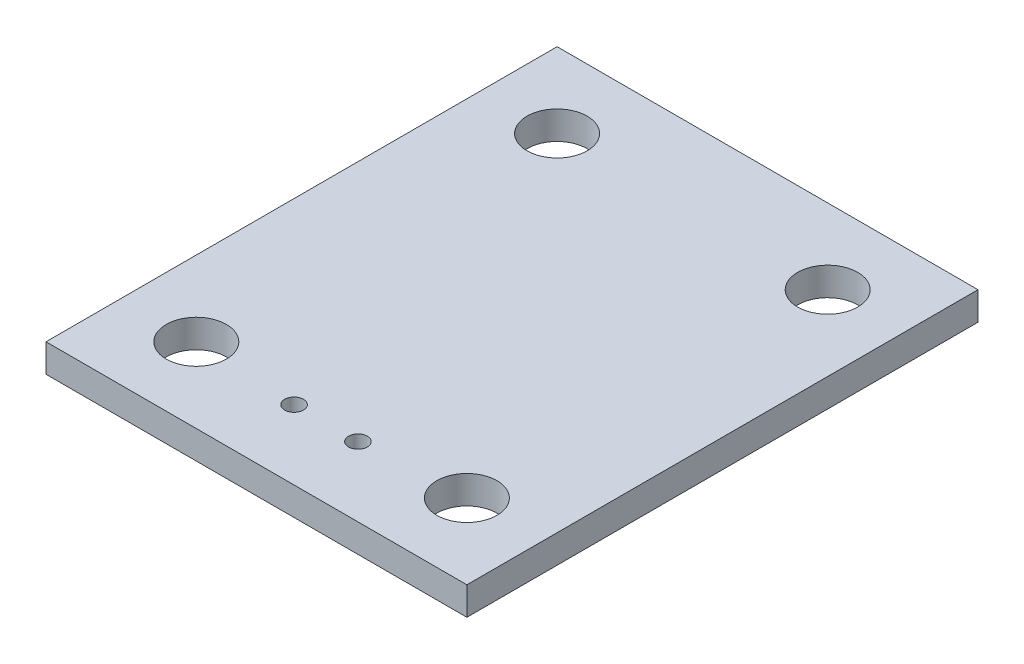
ISO-10303-21;
HEADER;
FILE_DESCRIPTION(('STEP AP214'),'2;1');
FILE_NAME('part.step','',(''),(''),'','','');
FILE_SCHEMA(('AUTOMOTIVE_DESIGN { 1 0 10303 214 1 1 1 1 }'));
ENDSEC;
DATA;
#1=APPLICATION_CONTEXT('core data for automotive mechanical design processes');
#2=APPLICATION_PROTOCOL_DEFINITION('international standard','automotive_design',2000,#1);
#3=PRODUCT_CONTEXT('',#1,'mechanical');
#4=PRODUCT('Part','Part','',(#3));
#5=PRODUCT_RELATED_PRODUCT_CATEGORY('part','',(#4));
#6=PRODUCT_DEFINITION_FORMATION('','',#4);
#7=PRODUCT_DEFINITION_CONTEXT('part definition',#1,'design');
#8=PRODUCT_DEFINITION('design','',#6,#7);
#9=PRODUCT_DEFINITION_SHAPE('','',#8);
#10=(LENGTH_UNIT() NAMED_UNIT(*) SI_UNIT(.MILLI.,.METRE.));
#11=(NAMED_UNIT(*) PLANE_ANGLE_UNIT() SI_UNIT($,.RADIAN.));
#12=(NAMED_UNIT(*) SI_UNIT($,.STERADIAN.) SOLID_ANGLE_UNIT());
#13=UNCERTAINTY_MEASURE_WITH_UNIT(LENGTH_MEASURE(1.E-05),#10,'distance_accuracy_value','');
#14=(GEOMETRIC_REPRESENTATION_CONTEXT(3) GLOBAL_UNCERTAINTY_ASSIGNED_CONTEXT((#13)) GLOBAL_UNIT_ASSIGNED_CONTEXT((#10,
#11,#12)) REPRESENTATION_CONTEXT('',''));
#15=CARTESIAN_POINT('',(0.,0.,0.));
#16=DIRECTION('',(0.,0.,1.));
#17=DIRECTION('',(1.,0.,0.));
#18=AXIS2_PLACEMENT_3D('',#15,#16,#17);
#19=CARTESIAN_POINT('',(-11.2,-1.5,-13.6));
#20=DIRECTION('',(-1.,0.,0.));
#21=DIRECTION('',(0.,0.,1.));
#22=AXIS2_PLACEMENT_3D('',#19,#20,#21);
#23=PLANE('',#22);
#24=DIRECTION('',(0.,0.,1.));
#25=VECTOR('',#24,1.);
#26=CARTESIAN_POINT('',(-11.2,0.,-13.6));
#27=LINE('',#26,#25);
#28=CARTESIAN_POINT('',(-11.2,0.,-13.6));
#29=VERTEX_POINT('',#28);
#30=CARTESIAN_POINT('',(-11.2,0.,13.6));
#31=VERTEX_POINT('',#30);
#32=EDGE_CURVE('E97',#29,#31,#27,.T.);
#33=ORIENTED_EDGE('',*,*,#32,.F.);
#34=DIRECTION('',(0.,1.,0.));
#35=VECTOR('',#34,1.);
#36=CARTESIAN_POINT('',(-11.2,-1.5,-13.6));
#37=LINE('',#36,#35);
#38=CARTESIAN_POINT('',(-11.2,-1.5,-13.6));
#39=VERTEX_POINT('',#38);
#40=EDGE_CURVE('E11',#39,#29,#37,.T.);
#41=ORIENTED_EDGE('',*,*,#40,.F.);
#42=DIRECTION('',(0.,0.,1.));
#43=VECTOR('',#42,1.);
#44=CARTESIAN_POINT('',(-11.2,-1.5,-13.6));
#45=LINE('',#44,#43);
#46=CARTESIAN_POINT('',(-11.2,-1.5,13.6));
#47=VERTEX_POINT('',#46);
#48=EDGE_CURVE('E90',#39,#47,#45,.T.);
#49=ORIENTED_EDGE('',*,*,#48,.T.);
#50=DIRECTION('',(0.,1.,0.));
#51=VECTOR('',#50,1.);
#52=CARTESIAN_POINT('',(-11.2,-1.5,13.6));
#53=LINE('',#52,#51);
#54=EDGE_CURVE('E35',#47,#31,#53,.T.);
#55=ORIENTED_EDGE('',*,*,#54,.T.);
#56=EDGE_LOOP('',(#33,#41,#49,#55));
#57=FACE_BOUND('',#56,.T.);
#58=ADVANCED_FACE('F32',(#57),#23,.T.);
#59=CARTESIAN_POINT('',(-11.2,-1.5,-13.6));
#60=DIRECTION('',(0.,0.,-1.));
#61=DIRECTION('',(-1.,0.,0.));
#62=AXIS2_PLACEMENT_3D('',#59,#60,#61);
#63=PLANE('',#62);
#64=DIRECTION('',(-1.,0.,0.));
#65=VECTOR('',#64,1.);
#66=CARTESIAN_POINT('',(-11.2,0.,-13.6));
#67=LINE('',#66,#65);
#68=CARTESIAN_POINT('',(11.2,0.,-13.6));
#69=VERTEX_POINT('',#68);
#70=EDGE_CURVE('E92',#69,#29,#67,.T.);
#71=ORIENTED_EDGE('',*,*,#70,.F.);
#72=DIRECTION('',(0.,1.,0.));
#73=VECTOR('',#72,1.);
#74=CARTESIAN_POINT('',(11.2,-1.5,-13.6));
#75=LINE('',#74,#73);
#76=CARTESIAN_POINT('',(11.2,-1.5,-13.6));
#77=VERTEX_POINT('',#76);
#78=EDGE_CURVE('E41',#77,#69,#75,.T.);
#79=ORIENTED_EDGE('',*,*,#78,.F.);
#80=DIRECTION('',(-1.,0.,0.));
#81=VECTOR('',#80,1.);
#82=CARTESIAN_POINT('',(-11.2,-1.5,-13.6));
#83=LINE('',#82,#81);
#84=EDGE_CURVE('E87',#77,#39,#83,.T.);
#85=ORIENTED_EDGE('',*,*,#84,.T.);
#86=ORIENTED_EDGE('',*,*,#40,.T.);
#87=EDGE_LOOP('',(#71,#79,#85,#86));
#88=FACE_BOUND('',#87,.T.);
#89=ADVANCED_FACE('F108',(#88),#63,.T.);
#90=CARTESIAN_POINT('',(11.2,-1.5,-13.6));
#91=DIRECTION('',(1.,0.,0.));
#92=DIRECTION('',(0.,0.,-1.));
#93=AXIS2_PLACEMENT_3D('',#90,#91,#92);
#94=PLANE('',#93);
#95=DIRECTION('',(0.,0.,-1.));
#96=VECTOR('',#95,1.);
#97=CARTESIAN_POINT('',(11.2,0.,-13.6));
#98=LINE('',#97,#96);
#99=CARTESIAN_POINT('',(11.2,0.,13.6));
#100=VERTEX_POINT('',#99);
#101=EDGE_CURVE('E82',#100,#69,#98,.T.);
#102=ORIENTED_EDGE('',*,*,#101,.F.);
#103=DIRECTION('',(0.,1.,0.));
#104=VECTOR('',#103,1.);
#105=CARTESIAN_POINT('',(11.2,-1.5,13.6));
#106=LINE('',#105,#104);
#107=CARTESIAN_POINT('',(11.2,-1.5,13.6));
#108=VERTEX_POINT('',#107);
#109=EDGE_CURVE('E77',#108,#100,#106,.T.);
#110=ORIENTED_EDGE('',*,*,#109,.F.);
#111=DIRECTION('',(0.,0.,-1.));
#112=VECTOR('',#111,1.);
#113=CARTESIAN_POINT('',(11.2,-1.5,-13.6));
#114=LINE('',#113,#112);
#115=EDGE_CURVE('E80',#108,#77,#114,.T.);
#116=ORIENTED_EDGE('',*,*,#115,.T.);
#117=ORIENTED_EDGE('',*,*,#78,.T.);
#118=EDGE_LOOP('',(#102,#110,#116,#117));
#119=FACE_BOUND('',#118,.T.);
#120=ADVANCED_FACE('F79',(#119),#94,.T.);
#121=CARTESIAN_POINT('',(-11.2,-1.5,13.6));
#122=DIRECTION('',(0.,0.,1.));
#123=DIRECTION('',(1.,0.,0.));
#124=AXIS2_PLACEMENT_3D('',#121,#122,#123);
#125=PLANE('',#124);
#126=DIRECTION('',(1.,0.,0.));
#127=VECTOR('',#126,1.);
#128=CARTESIAN_POINT('',(-11.2,0.,13.6));
#129=LINE('',#128,#127);
#130=EDGE_CURVE('E100',#31,#100,#129,.T.);
#131=ORIENTED_EDGE('',*,*,#130,.F.);
#132=ORIENTED_EDGE('',*,*,#54,.F.);
#133=DIRECTION('',(1.,0.,0.));
#134=VECTOR('',#133,1.);
#135=CARTESIAN_POINT('',(-11.2,-1.5,13.6));
#136=LINE('',#135,#134);
#137=EDGE_CURVE('E86',#47,#108,#136,.T.);
#138=ORIENTED_EDGE('',*,*,#137,.T.);
#139=ORIENTED_EDGE('',*,*,#109,.T.);
#140=EDGE_LOOP('',(#131,#132,#138,#139));
#141=FACE_BOUND('',#140,.T.);
#142=ADVANCED_FACE('F89',(#141),#125,.T.);
#143=CARTESIAN_POINT('',(0.,-1.5,0.));
#144=DIRECTION('',(0.,1.,0.));
#145=DIRECTION('',(0.,0.,1.));
#146=AXIS2_PLACEMENT_3D('',#143,#144,#145);
#147=PLANE('',#146);
#148=CARTESIAN_POINT('',(7.2,-1.5,9.59999999999999));
#149=DIRECTION('',(0.,1.,0.));
#150=DIRECTION('',(0.,0.,1.));
#151=AXIS2_PLACEMENT_3D('',#148,#149,#150);
#152=CIRCLE('',#151,1.6);
#153=CARTESIAN_POINT('',(7.2,-1.5,11.2));
#154=VERTEX_POINT('',#153);
#155=EDGE_CURVE('E157',#154,#154,#152,.T.);
#156=ORIENTED_EDGE('',*,*,#155,.T.);
#157=EDGE_LOOP('',(#156));
#158=FACE_BOUND('',#157,.T.);
#159=CARTESIAN_POINT('',(1.7,-1.5,9.9));
#160=DIRECTION('',(0.,1.,0.));
#161=DIRECTION('',(0.,0.,1.));
#162=AXIS2_PLACEMENT_3D('',#159,#160,#161);
#163=CIRCLE('',#162,0.5);
#164=CARTESIAN_POINT('',(1.7,-1.5,10.4));
#165=VERTEX_POINT('',#164);
#166=EDGE_CURVE('E165',#165,#165,#163,.T.);
#167=ORIENTED_EDGE('',*,*,#166,.T.);
#168=EDGE_LOOP('',(#167));
#169=FACE_BOUND('',#168,.T.);
#170=CARTESIAN_POINT('',(-1.7,-1.5,9.9));
#171=DIRECTION('',(0.,1.,0.));
#172=DIRECTION('',(0.,0.,1.));
#173=AXIS2_PLACEMENT_3D('',#170,#171,#172);
#174=CIRCLE('',#173,0.5);
#175=CARTESIAN_POINT('',(-1.7,-1.5,10.4));
#176=VERTEX_POINT('',#175);
#177=EDGE_CURVE('E171',#176,#176,#174,.T.);
#178=ORIENTED_EDGE('',*,*,#177,.T.);
#179=EDGE_LOOP('',(#178));
#180=FACE_BOUND('',#179,.T.);
#181=CARTESIAN_POINT('',(-7.2,-1.5,9.59999999999999));
#182=DIRECTION('',(0.,1.,0.));
#183=DIRECTION('',(0.,0.,1.));
#184=AXIS2_PLACEMENT_3D('',#181,#182,#183);
#185=CIRCLE('',#184,1.6);
#186=CARTESIAN_POINT('',(-7.2,-1.5,11.2));
#187=VERTEX_POINT('',#186);
#188=EDGE_CURVE('E177',#187,#187,#185,.T.);
#189=ORIENTED_EDGE('',*,*,#188,.T.);
#190=EDGE_LOOP('',(#189));
#191=FACE_BOUND('',#190,.T.);
#192=CARTESIAN_POINT('',(-7.2,-1.5,-9.6));
#193=DIRECTION('',(0.,1.,0.));
#194=DIRECTION('',(0.,0.,1.));
#195=AXIS2_PLACEMENT_3D('',#192,#193,#194);
#196=CIRCLE('',#195,1.6);
#197=CARTESIAN_POINT('',(-7.2,-1.5,-8.));
#198=VERTEX_POINT('',#197);
#199=EDGE_CURVE('E183',#198,#198,#196,.T.);
#200=ORIENTED_EDGE('',*,*,#199,.T.);
#201=EDGE_LOOP('',(#200));
#202=FACE_BOUND('',#201,.T.);
#203=CARTESIAN_POINT('',(7.2,-1.5,-9.6));
#204=DIRECTION('',(0.,1.,0.));
#205=DIRECTION('',(0.,0.,1.));
#206=AXIS2_PLACEMENT_3D('',#203,#204,#205);
#207=CIRCLE('',#206,1.6);
#208=CARTESIAN_POINT('',(7.2,-1.5,-8.));
#209=VERTEX_POINT('',#208);
#210=EDGE_CURVE('E101',#209,#209,#207,.T.);
#211=ORIENTED_EDGE('',*,*,#210,.T.);
#212=EDGE_LOOP('',(#211));
#213=FACE_BOUND('',#212,.T.);
#214=ORIENTED_EDGE('',*,*,#48,.F.);
#215=ORIENTED_EDGE('',*,*,#84,.F.);
#216=ORIENTED_EDGE('',*,*,#115,.F.);
#217=ORIENTED_EDGE('',*,*,#137,.F.);
#218=EDGE_LOOP('',(#214,#215,#216,#217));
#219=FACE_BOUND('',#218,.T.);
#220=ADVANCED_FACE('F85',(#158,#169,#180,#191,#202,#213,#219),#147,.F.);
#221=CARTESIAN_POINT('',(0.,0.,0.));
#222=DIRECTION('',(0.,1.,0.));
#223=DIRECTION('',(0.,0.,1.));
#224=AXIS2_PLACEMENT_3D('',#221,#222,#223);
#225=PLANE('',#224);
#226=CARTESIAN_POINT('',(7.2,0.,9.59999999999999));
#227=DIRECTION('',(0.,1.,0.));
#228=DIRECTION('',(0.,0.,1.));
#229=AXIS2_PLACEMENT_3D('',#226,#227,#228);
#230=CIRCLE('',#229,1.6);
#231=CARTESIAN_POINT('',(7.2,0.,11.2));
#232=VERTEX_POINT('',#231);
#233=EDGE_CURVE('E160',#232,#232,#230,.T.);
#234=ORIENTED_EDGE('',*,*,#233,.F.);
#235=EDGE_LOOP('',(#234));
#236=FACE_BOUND('',#235,.T.);
#237=CARTESIAN_POINT('',(1.7,0.,9.9));
#238=DIRECTION('',(0.,1.,0.));
#239=DIRECTION('',(0.,0.,1.));
#240=AXIS2_PLACEMENT_3D('',#237,#238,#239);
#241=CIRCLE('',#240,0.5);
#242=CARTESIAN_POINT('',(1.7,0.,10.4));
#243=VERTEX_POINT('',#242);
#244=EDGE_CURVE('E162',#243,#243,#241,.T.);
#245=ORIENTED_EDGE('',*,*,#244,.F.);
#246=EDGE_LOOP('',(#245));
#247=FACE_BOUND('',#246,.T.);
#248=CARTESIAN_POINT('',(-1.7,0.,9.9));
#249=DIRECTION('',(0.,1.,0.));
#250=DIRECTION('',(0.,0.,1.));
#251=AXIS2_PLACEMENT_3D('',#248,#249,#250);
#252=CIRCLE('',#251,0.5);
#253=CARTESIAN_POINT('',(-1.7,0.,10.4));
#254=VERTEX_POINT('',#253);
#255=EDGE_CURVE('E168',#254,#254,#252,.T.);
#256=ORIENTED_EDGE('',*,*,#255,.F.);
#257=EDGE_LOOP('',(#256));
#258=FACE_BOUND('',#257,.T.);
#259=CARTESIAN_POINT('',(-7.2,0.,9.59999999999999));
#260=DIRECTION('',(0.,1.,0.));
#261=DIRECTION('',(0.,0.,1.));
#262=AXIS2_PLACEMENT_3D('',#259,#260,#261);
#263=CIRCLE('',#262,1.6);
#264=CARTESIAN_POINT('',(-7.2,0.,11.2));
#265=VERTEX_POINT('',#264);
#266=EDGE_CURVE('E174',#265,#265,#263,.T.);
#267=ORIENTED_EDGE('',*,*,#266,.F.);
#268=EDGE_LOOP('',(#267));
#269=FACE_BOUND('',#268,.T.);
#270=CARTESIAN_POINT('',(-7.2,0.,-9.6));
#271=DIRECTION('',(0.,1.,0.));
#272=DIRECTION('',(0.,0.,1.));
#273=AXIS2_PLACEMENT_3D('',#270,#271,#272);
#274=CIRCLE('',#273,1.6);
#275=CARTESIAN_POINT('',(-7.2,0.,-8.));
#276=VERTEX_POINT('',#275);
#277=EDGE_CURVE('E180',#276,#276,#274,.T.);
#278=ORIENTED_EDGE('',*,*,#277,.F.);
#279=EDGE_LOOP('',(#278));
#280=FACE_BOUND('',#279,.T.);
#281=CARTESIAN_POINT('',(7.2,0.,-9.6));
#282=DIRECTION('',(0.,1.,0.));
#283=DIRECTION('',(0.,0.,1.));
#284=AXIS2_PLACEMENT_3D('',#281,#282,#283);
#285=CIRCLE('',#284,1.6);
#286=CARTESIAN_POINT('',(7.2,0.,-8.));
#287=VERTEX_POINT('',#286);
#288=EDGE_CURVE('E186',#287,#287,#285,.T.);
#289=ORIENTED_EDGE('',*,*,#288,.F.);
#290=EDGE_LOOP('',(#289));
#291=FACE_BOUND('',#290,.T.);
#292=ORIENTED_EDGE('',*,*,#32,.T.);
#293=ORIENTED_EDGE('',*,*,#130,.T.);
#294=ORIENTED_EDGE('',*,*,#101,.T.);
#295=ORIENTED_EDGE('',*,*,#70,.T.);
#296=EDGE_LOOP('',(#292,#293,#294,#295));
#297=FACE_BOUND('',#296,.T.);
#298=ADVANCED_FACE('F107',(#236,#247,#258,#269,#280,#291,#297),#225,.T.);
#299=CARTESIAN_POINT('',(7.2,-1.5,-9.6));
#300=DIRECTION('',(0.,1.,0.));
#301=DIRECTION('',(0.,0.,1.));
#302=AXIS2_PLACEMENT_3D('',#299,#300,#301);
#303=CYLINDRICAL_SURFACE('',#302,1.6);
#304=ORIENTED_EDGE('',*,*,#210,.F.);
#305=EDGE_LOOP('',(#304));
#306=FACE_BOUND('',#305,.T.);
#307=ORIENTED_EDGE('',*,*,#288,.T.);
#308=EDGE_LOOP('',(#307));
#309=FACE_BOUND('',#308,.T.);
#310=ADVANCED_FACE('F126',(#306,#309),#303,.F.);
#311=CARTESIAN_POINT('',(-7.2,-1.5,-9.6));
#312=DIRECTION('',(0.,1.,0.));
#313=DIRECTION('',(0.,0.,1.));
#314=AXIS2_PLACEMENT_3D('',#311,#312,#313);
#315=CYLINDRICAL_SURFACE('',#314,1.6);
#316=ORIENTED_EDGE('',*,*,#199,.F.);
#317=EDGE_LOOP('',(#316));
#318=FACE_BOUND('',#317,.T.);
#319=ORIENTED_EDGE('',*,*,#277,.T.);
#320=EDGE_LOOP('',(#319));
#321=FACE_BOUND('',#320,.T.);
#322=ADVANCED_FACE('F133',(#318,#321),#315,.F.);
#323=CARTESIAN_POINT('',(-7.2,-1.5,9.59999999999999));
#324=DIRECTION('',(0.,1.,0.));
#325=DIRECTION('',(0.,0.,1.));
#326=AXIS2_PLACEMENT_3D('',#323,#324,#325);
#327=CYLINDRICAL_SURFACE('',#326,1.6);
#328=ORIENTED_EDGE('',*,*,#188,.F.);
#329=EDGE_LOOP('',(#328));
#330=FACE_BOUND('',#329,.T.);
#331=ORIENTED_EDGE('',*,*,#266,.T.);
#332=EDGE_LOOP('',(#331));
#333=FACE_BOUND('',#332,.T.);
#334=ADVANCED_FACE('F137',(#330,#333),#327,.F.);
#335=CARTESIAN_POINT('',(-1.7,-1.5,9.9));
#336=DIRECTION('',(0.,1.,0.));
#337=DIRECTION('',(0.,0.,1.));
#338=AXIS2_PLACEMENT_3D('',#335,#336,#337);
#339=CYLINDRICAL_SURFACE('',#338,0.5);
#340=ORIENTED_EDGE('',*,*,#177,.F.);
#341=EDGE_LOOP('',(#340));
#342=FACE_BOUND('',#341,.T.);
#343=ORIENTED_EDGE('',*,*,#255,.T.);
#344=EDGE_LOOP('',(#343));
#345=FACE_BOUND('',#344,.T.);
#346=ADVANCED_FACE('F141',(#342,#345),#339,.F.);
#347=CARTESIAN_POINT('',(1.7,-1.5,9.9));
#348=DIRECTION('',(0.,1.,0.));
#349=DIRECTION('',(0.,0.,1.));
#350=AXIS2_PLACEMENT_3D('',#347,#348,#349);
#351=CYLINDRICAL_SURFACE('',#350,0.5);
#352=ORIENTED_EDGE('',*,*,#166,.F.);
#353=EDGE_LOOP('',(#352));
#354=FACE_BOUND('',#353,.T.);
#355=ORIENTED_EDGE('',*,*,#244,.T.);
#356=EDGE_LOOP('',(#355));
#357=FACE_BOUND('',#356,.T.);
#358=ADVANCED_FACE('F145',(#354,#357),#351,.F.);
#359=CARTESIAN_POINT('',(7.2,-1.5,9.59999999999999));
#360=DIRECTION('',(0.,1.,0.));
#361=DIRECTION('',(0.,0.,1.));
#362=AXIS2_PLACEMENT_3D('',#359,#360,#361);
#363=CYLINDRICAL_SURFACE('',#362,1.6);
#364=ORIENTED_EDGE('',*,*,#155,.F.);
#365=EDGE_LOOP('',(#364));
#366=FACE_BOUND('',#365,.T.);
#367=ORIENTED_EDGE('',*,*,#233,.T.);
#368=EDGE_LOOP('',(#367));
#369=FACE_BOUND('',#368,.T.);
#370=ADVANCED_FACE('F149',(#366,#369),#363,.F.);
#371=CLOSED_SHELL('',(#58,#89,#120,#142,#220,#298,#310,#322,#334,#346,#358,#370));
#372=MANIFOLD_SOLID_BREP('B2',#371);
#373=ADVANCED_BREP_SHAPE_REPRESENTATION('',(#18,#372),#14);
#374=SHAPE_DEFINITION_REPRESENTATION(#9,#373);
ENDSEC;
END-ISO-10303-21;
